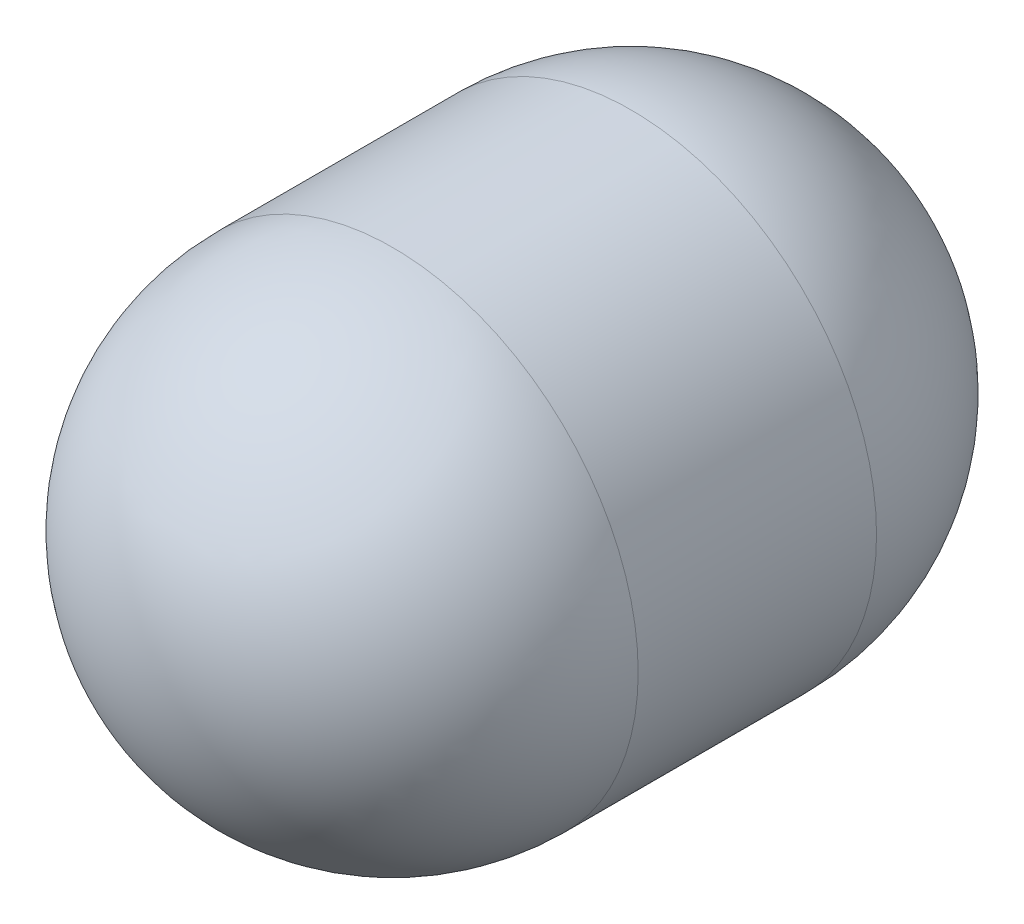
ISO-10303-21;
HEADER;
FILE_DESCRIPTION(('STEP AP214'),'2;1');
FILE_NAME('part.step','',(''),(''),'','','');
FILE_SCHEMA(('AUTOMOTIVE_DESIGN { 1 0 10303 214 1 1 1 1 }'));
ENDSEC;
DATA;
#1=APPLICATION_CONTEXT('core data for automotive mechanical design processes');
#2=APPLICATION_PROTOCOL_DEFINITION('international standard','automotive_design',2000,#1);
#3=PRODUCT_CONTEXT('',#1,'mechanical');
#4=PRODUCT('Part','Part','',(#3));
#5=PRODUCT_RELATED_PRODUCT_CATEGORY('part','',(#4));
#6=PRODUCT_DEFINITION_FORMATION('','',#4);
#7=PRODUCT_DEFINITION_CONTEXT('part definition',#1,'design');
#8=PRODUCT_DEFINITION('design','',#6,#7);
#9=PRODUCT_DEFINITION_SHAPE('','',#8);
#10=(LENGTH_UNIT() NAMED_UNIT(*) SI_UNIT(.MILLI.,.METRE.));
#11=(NAMED_UNIT(*) PLANE_ANGLE_UNIT() SI_UNIT($,.RADIAN.));
#12=(NAMED_UNIT(*) SI_UNIT($,.STERADIAN.) SOLID_ANGLE_UNIT());
#13=UNCERTAINTY_MEASURE_WITH_UNIT(LENGTH_MEASURE(1.E-05),#10,'distance_accuracy_value','');
#14=(GEOMETRIC_REPRESENTATION_CONTEXT(3) GLOBAL_UNCERTAINTY_ASSIGNED_CONTEXT((#13)) GLOBAL_UNIT_ASSIGNED_CONTEXT((#10,
#11,#12)) REPRESENTATION_CONTEXT('',''));
#15=CARTESIAN_POINT('',(0.,0.,0.));
#16=DIRECTION('',(0.,0.,1.));
#17=DIRECTION('',(1.,0.,0.));
#18=AXIS2_PLACEMENT_3D('',#15,#16,#17);
#19=CARTESIAN_POINT('',(0.,0.,-80.6816221177886));
#20=DIRECTION('',(0.,0.,-1.));
#21=DIRECTION('',(-1.,0.,0.));
#22=AXIS2_PLACEMENT_3D('',#19,#20,#21);
#23=CYLINDRICAL_SURFACE('',#22,55.5625);
#24=CARTESIAN_POINT('',(0.,0.,-26.9875));
#25=DIRECTION('',(0.,0.,-1.));
#26=DIRECTION('',(-1.,0.,0.));
#27=AXIS2_PLACEMENT_3D('',#24,#25,#26);
#28=CIRCLE('',#27,55.5625);
#29=CARTESIAN_POINT('',(-55.5625,0.,-26.9875));
#30=VERTEX_POINT('',#29);
#31=EDGE_CURVE('E10',#30,#30,#28,.T.);
#32=ORIENTED_EDGE('',*,*,#31,.F.);
#33=EDGE_LOOP('',(#32));
#34=FACE_BOUND('',#33,.T.);
#35=CARTESIAN_POINT('',(0.,0.,26.9875));
#36=DIRECTION('',(0.,0.,-1.));
#37=DIRECTION('',(-1.,0.,0.));
#38=AXIS2_PLACEMENT_3D('',#35,#36,#37);
#39=CIRCLE('',#38,55.5625);
#40=CARTESIAN_POINT('',(-55.5625,0.,26.9875));
#41=VERTEX_POINT('',#40);
#42=EDGE_CURVE('E46',#41,#41,#39,.T.);
#43=ORIENTED_EDGE('',*,*,#42,.T.);
#44=EDGE_LOOP('',(#43));
#45=FACE_BOUND('',#44,.T.);
#46=ADVANCED_FACE('F36',(#34,#45),#23,.T.);
#47=CARTESIAN_POINT('',(0.,0.,-26.9875));
#48=DIRECTION('',(0.,0.,-1.));
#49=DIRECTION('',(1.,0.,0.));
#50=AXIS2_PLACEMENT_3D('',#47,#48,#49);
#51=SPHERICAL_SURFACE('',#50,55.5625);
#52=CARTESIAN_POINT('',(0.,0.,-80.6816221177886));
#53=DIRECTION('',(0.,0.,-1.));
#54=DIRECTION('',(-1.,0.,0.));
#55=AXIS2_PLACEMENT_3D('',#52,#53,#54);
#56=CIRCLE('',#55,14.2875);
#57=CARTESIAN_POINT('',(-14.2875,0.,-80.6816221177886));
#58=VERTEX_POINT('',#57);
#59=EDGE_CURVE('E42',#58,#58,#56,.T.);
#60=ORIENTED_EDGE('',*,*,#59,.F.);
#61=EDGE_LOOP('',(#60));
#62=FACE_BOUND('',#61,.T.);
#63=ORIENTED_EDGE('',*,*,#31,.T.);
#64=EDGE_LOOP('',(#63));
#65=FACE_BOUND('',#64,.T.);
#66=ADVANCED_FACE('F61',(#62,#65),#51,.T.);
#67=CARTESIAN_POINT('',(0.,0.,-80.6816221177886));
#68=DIRECTION('',(0.,0.,-1.));
#69=DIRECTION('',(-1.,0.,0.));
#70=AXIS2_PLACEMENT_3D('',#67,#68,#69);
#71=PLANE('',#70);
#72=ORIENTED_EDGE('',*,*,#59,.T.);
#73=EDGE_LOOP('',(#72));
#74=FACE_BOUND('',#73,.T.);
#75=ADVANCED_FACE('F56',(#74),#71,.T.);
#76=CARTESIAN_POINT('',(0.,0.,26.9875));
#77=DIRECTION('',(0.,0.,-1.));
#78=DIRECTION('',(1.,0.,0.));
#79=AXIS2_PLACEMENT_3D('',#76,#77,#78);
#80=SPHERICAL_SURFACE('',#79,55.5625);
#81=ORIENTED_EDGE('',*,*,#42,.F.);
#82=EDGE_LOOP('',(#81));
#83=FACE_BOUND('',#82,.T.);
#84=ADVANCED_FACE('F54',(#83),#80,.T.);
#85=CLOSED_SHELL('',(#46,#66,#75,#84));
#86=MANIFOLD_SOLID_BREP('B2',#85);
#87=ADVANCED_BREP_SHAPE_REPRESENTATION('',(#18,#86),#14);
#88=SHAPE_DEFINITION_REPRESENTATION(#9,#87);
ENDSEC;
END-ISO-10303-21;
